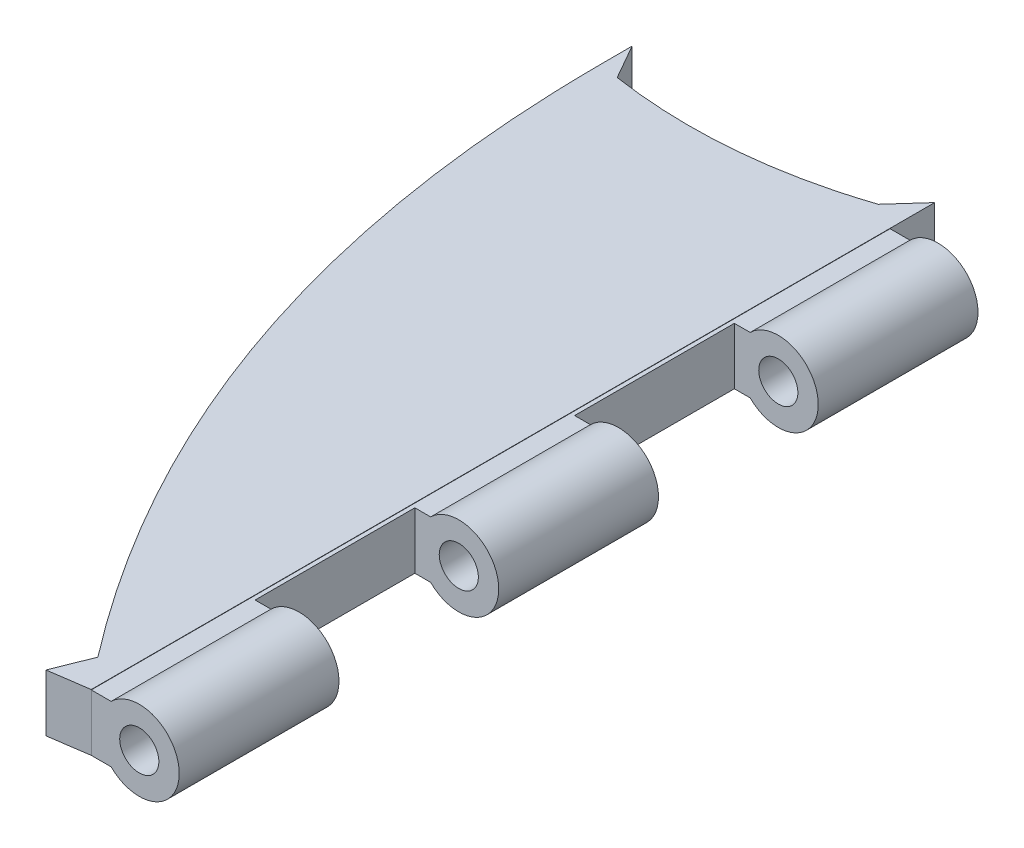
ISO-10303-21;
HEADER;
FILE_DESCRIPTION(('STEP AP214'),'2;1');
FILE_NAME('part.step','',(''),(''),'','','');
FILE_SCHEMA(('AUTOMOTIVE_DESIGN { 1 0 10303 214 1 1 1 1 }'));
ENDSEC;
DATA;
#1=APPLICATION_CONTEXT('core data for automotive mechanical design processes');
#2=APPLICATION_PROTOCOL_DEFINITION('international standard','automotive_design',2000,#1);
#3=PRODUCT_CONTEXT('',#1,'mechanical');
#4=PRODUCT('Part','Part','',(#3));
#5=PRODUCT_RELATED_PRODUCT_CATEGORY('part','',(#4));
#6=PRODUCT_DEFINITION_FORMATION('','',#4);
#7=PRODUCT_DEFINITION_CONTEXT('part definition',#1,'design');
#8=PRODUCT_DEFINITION('design','',#6,#7);
#9=PRODUCT_DEFINITION_SHAPE('','',#8);
#10=(LENGTH_UNIT() NAMED_UNIT(*) SI_UNIT(.MILLI.,.METRE.));
#11=(NAMED_UNIT(*) PLANE_ANGLE_UNIT() SI_UNIT($,.RADIAN.));
#12=(NAMED_UNIT(*) SI_UNIT($,.STERADIAN.) SOLID_ANGLE_UNIT());
#13=UNCERTAINTY_MEASURE_WITH_UNIT(LENGTH_MEASURE(1.E-05),#10,'distance_accuracy_value','');
#14=(GEOMETRIC_REPRESENTATION_CONTEXT(3) GLOBAL_UNCERTAINTY_ASSIGNED_CONTEXT((#13)) GLOBAL_UNIT_ASSIGNED_CONTEXT((#10,
#11,#12)) REPRESENTATION_CONTEXT('',''));
#15=CARTESIAN_POINT('',(0.,0.,0.));
#16=DIRECTION('',(0.,0.,1.));
#17=DIRECTION('',(1.,0.,0.));
#18=AXIS2_PLACEMENT_3D('',#15,#16,#17);
#19=CARTESIAN_POINT('',(32.973414944307,-27.0329938832796,64.215461931735));
#20=DIRECTION('',(1.,0.,0.));
#21=DIRECTION('',(0.,0.,-1.));
#22=AXIS2_PLACEMENT_3D('',#19,#20,#21);
#23=PLANE('',#22);
#24=DIRECTION('',(0.,0.,-1.));
#25=VECTOR('',#24,1.);
#26=CARTESIAN_POINT('',(32.973414944307,-22.2115612420524,85.1997859033219));
#27=LINE('',#26,#25);
#28=CARTESIAN_POINT('',(32.973414944307,-22.2115612420524,105.673013537152));
#29=VERTEX_POINT('',#28);
#30=CARTESIAN_POINT('',(32.973414944307,-22.2115612420524,68.719194514338));
#31=VERTEX_POINT('',#30);
#32=EDGE_CURVE('P0_E180',#29,#31,#27,.T.);
#33=ORIENTED_EDGE('',*,*,#32,.F.);
#34=DIRECTION('',(0.,-1.,0.));
#35=VECTOR('',#34,1.);
#36=CARTESIAN_POINT('',(32.973414944307,-22.2115612420524,105.673013537152));
#37=LINE('',#36,#35);
#38=CARTESIAN_POINT('',(32.973414944307,-24.7115612420524,105.673013537152));
#39=VERTEX_POINT('',#38);
#40=EDGE_CURVE('P0_E21',#29,#39,#37,.T.);
#41=ORIENTED_EDGE('',*,*,#40,.T.);
#42=DIRECTION('',(0.,0.,-1.));
#43=VECTOR('',#42,1.);
#44=CARTESIAN_POINT('',(32.973414944307,-24.7115612420524,85.1997859033219));
#45=LINE('',#44,#43);
#46=CARTESIAN_POINT('',(32.973414944307,-24.7115612420524,68.719194514338));
#47=VERTEX_POINT('',#46);
#48=EDGE_CURVE('P0_E181',#39,#47,#45,.T.);
#49=ORIENTED_EDGE('',*,*,#48,.T.);
#50=DIRECTION('',(0.,-1.,0.));
#51=VECTOR('',#50,1.);
#52=CARTESIAN_POINT('',(32.973414944307,-22.2115612420524,68.719194514338));
#53=LINE('',#52,#51);
#54=EDGE_CURVE('P0_E36',#31,#47,#53,.T.);
#55=ORIENTED_EDGE('',*,*,#54,.F.);
#56=EDGE_LOOP('',(#33,#41,#49,#55));
#57=FACE_BOUND('',#56,.T.);
#58=ADVANCED_FACE('P0_F17',(#57),#23,.T.);
#59=CARTESIAN_POINT('',(28.5920164881596,-22.2115612420524,73.5836619992147));
#60=DIRECTION('',(-0.743037546914948,0.,-0.669249732069141));
#61=DIRECTION('',(-0.669249732069141,0.,0.743037546914948));
#62=AXIS2_PLACEMENT_3D('',#59,#60,#61);
#63=PLANE('',#62);
#64=DIRECTION('',(0.669249732069141,0.,-0.743037546914948));
#65=VECTOR('',#64,1.);
#66=CARTESIAN_POINT('',(28.5920164881596,-24.7115612420524,73.5836619992147));
#67=LINE('',#66,#65);
#68=CARTESIAN_POINT('',(31.802227913186,-24.7115612420524,70.0195102214392));
#69=VERTEX_POINT('',#68);
#70=EDGE_CURVE('P0_E11',#69,#47,#67,.T.);
#71=ORIENTED_EDGE('',*,*,#70,.F.);
#72=DIRECTION('',(0.,-1.,0.));
#73=VECTOR('',#72,1.);
#74=CARTESIAN_POINT('',(31.802227913186,-22.2115612420524,70.0195102214392));
#75=LINE('',#74,#73);
#76=CARTESIAN_POINT('',(31.802227913186,-22.2115612420524,70.0195102214392));
#77=VERTEX_POINT('',#76);
#78=EDGE_CURVE('P0_E62',#77,#69,#75,.T.);
#79=ORIENTED_EDGE('',*,*,#78,.F.);
#80=DIRECTION('',(0.669249732069141,0.,-0.743037546914948));
#81=VECTOR('',#80,1.);
#82=CARTESIAN_POINT('',(28.5920164881596,-22.2115612420524,73.5836619992147));
#83=LINE('',#82,#81);
#84=EDGE_CURVE('P0_E173',#77,#31,#83,.T.);
#85=ORIENTED_EDGE('',*,*,#84,.T.);
#86=ORIENTED_EDGE('',*,*,#54,.T.);
#87=EDGE_LOOP('',(#71,#79,#85,#86));
#88=FACE_BOUND('',#87,.T.);
#89=ADVANCED_FACE('P0_F152',(#88),#63,.T.);
#90=CARTESIAN_POINT('',(21.2730054031297,-22.2115612420524,70.929062851696));
#91=CARTESIAN_POINT('',(23.1096896542794,-22.2115612420524,71.2034177692164));
#92=CARTESIAN_POINT('',(26.6576690567559,-22.2115612420524,71.309837281146));
#93=CARTESIAN_POINT('',(30.1273092090926,-22.2115612420524,70.5771027146462));
#94=CARTESIAN_POINT('',(31.802227913186,-22.2115612420524,70.0195102214392));
#95=B_SPLINE_CURVE_WITH_KNOTS('',3,(#90,#91,#92,#93,#94),.UNSPECIFIED.,.F.,.F.,(4,1,4),
(0.0670189865663111,0.495699029989057,0.904472852935776),.UNSPECIFIED.);
#96=DIRECTION('',(0.,-1.,0.));
#97=VECTOR('',#96,1.);
#98=SURFACE_OF_LINEAR_EXTRUSION('',#95,#97);
#99=CARTESIAN_POINT('',(21.2730054031297,-24.7115612420524,70.929062851696));
#100=CARTESIAN_POINT('',(23.1096896542794,-24.7115612420524,71.2034177692164));
#101=CARTESIAN_POINT('',(26.6576690567559,-24.7115612420524,71.309837281146));
#102=CARTESIAN_POINT('',(30.1273092090926,-24.7115612420524,70.5771027146462));
#103=CARTESIAN_POINT('',(31.802227913186,-24.7115612420524,70.0195102214392));
#104=B_SPLINE_CURVE_WITH_KNOTS('',3,(#99,#100,#101,#102,#103),.UNSPECIFIED.,.F.,.F.,(4,1,4),
(0.0670189865663111,0.495699029989057,0.904472852935776),.UNSPECIFIED.);
#105=CARTESIAN_POINT('',(21.2730054031295,-24.7115612420524,70.929062851696));
#106=VERTEX_POINT('',#105);
#107=EDGE_CURVE('P0_E27',#106,#69,#104,.T.);
#108=ORIENTED_EDGE('',*,*,#107,.F.);
#109=DIRECTION('',(0.,-1.,0.));
#110=VECTOR('',#109,1.);
#111=CARTESIAN_POINT('',(21.2730054031295,-22.2115612420524,70.929062851696));
#112=LINE('',#111,#110);
#113=CARTESIAN_POINT('',(21.2730054031295,-22.2115612420524,70.929062851696));
#114=VERTEX_POINT('',#113);
#115=EDGE_CURVE('P0_E87',#114,#106,#112,.T.);
#116=ORIENTED_EDGE('',*,*,#115,.F.);
#117=EDGE_CURVE('P0_E168',#114,#77,#95,.T.);
#118=ORIENTED_EDGE('',*,*,#117,.T.);
#119=ORIENTED_EDGE('',*,*,#78,.T.);
#120=EDGE_LOOP('',(#108,#116,#118,#119));
#121=FACE_BOUND('',#120,.T.);
#122=ADVANCED_FACE('P0_F101',(#121),#98,.T.);
#123=CARTESIAN_POINT('',(32.3640598845518,-22.2115612420524,90.3980028418056));
#124=DIRECTION('',(0.868897082531414,0.,-0.494992787794325));
#125=DIRECTION('',(-0.494992787794325,0.,-0.868897082531414));
#126=AXIS2_PLACEMENT_3D('',#123,#124,#125);
#127=PLANE('',#126);
#128=DIRECTION('',(0.494992787794325,0.,0.868897082531414));
#129=VECTOR('',#128,1.);
#130=CARTESIAN_POINT('',(32.3640598845518,-24.7115612420524,90.3980028418056));
#131=LINE('',#130,#129);
#132=CARTESIAN_POINT('',(20.4067680244895,-24.7115612420524,69.4084929572661));
#133=VERTEX_POINT('',#132);
#134=EDGE_CURVE('P0_E91',#133,#106,#131,.T.);
#135=ORIENTED_EDGE('',*,*,#134,.F.);
#136=DIRECTION('',(0.,-1.,0.));
#137=VECTOR('',#136,1.);
#138=CARTESIAN_POINT('',(20.4067680244895,-22.2115612420524,69.4084929572661));
#139=LINE('',#138,#137);
#140=CARTESIAN_POINT('',(20.4067680244895,-22.2115612420524,69.4084929572661));
#141=VERTEX_POINT('',#140);
#142=EDGE_CURVE('P0_E98',#141,#133,#139,.T.);
#143=ORIENTED_EDGE('',*,*,#142,.F.);
#144=DIRECTION('',(0.494992787794325,0.,0.868897082531414));
#145=VECTOR('',#144,1.);
#146=CARTESIAN_POINT('',(32.3640598845518,-22.2115612420524,90.3980028418056));
#147=LINE('',#146,#145);
#148=EDGE_CURVE('P0_E94',#141,#114,#147,.T.);
#149=ORIENTED_EDGE('',*,*,#148,.T.);
#150=ORIENTED_EDGE('',*,*,#115,.T.);
#151=EDGE_LOOP('',(#135,#143,#149,#150));
#152=FACE_BOUND('',#151,.T.);
#153=ADVANCED_FACE('P0_F89',(#152),#127,.T.);
#154=CARTESIAN_POINT('',(20.4447847920618,-22.2115612420524,85.2502870093976));
#155=DIRECTION('',(-0.999997120548435,0.,0.00239976974702144));
#156=DIRECTION('',(0.00239976974702144,0.,0.999997120548435));
#157=AXIS2_PLACEMENT_3D('',#154,#155,#156);
#158=PLANE('',#157);
#159=DIRECTION('',(-0.00239976974702139,0.,-0.999997120548435));
#160=VECTOR('',#159,1.);
#161=CARTESIAN_POINT('',(20.4447847920618,-24.7115612420524,85.2502870093976));
#162=LINE('',#161,#160);
#163=CARTESIAN_POINT('',(20.410069567425,-24.7115612420524,70.7842638756756));
#164=VERTEX_POINT('',#163);
#165=EDGE_CURVE('P0_E106',#164,#133,#162,.T.);
#166=ORIENTED_EDGE('',*,*,#165,.F.);
#167=DIRECTION('',(0.,-1.,0.));
#168=VECTOR('',#167,1.);
#169=CARTESIAN_POINT('',(20.410069567425,-22.2115612420524,70.7842638756756));
#170=LINE('',#169,#168);
#171=CARTESIAN_POINT('',(20.410069567425,-22.2115612420524,70.7842638756756));
#172=VERTEX_POINT('',#171);
#173=EDGE_CURVE('P0_E199',#172,#164,#170,.T.);
#174=ORIENTED_EDGE('',*,*,#173,.F.);
#175=DIRECTION('',(-0.00239976974702139,0.,-0.999997120548435));
#176=VECTOR('',#175,1.);
#177=CARTESIAN_POINT('',(20.4447847920618,-22.2115612420524,85.2502870093976));
#178=LINE('',#177,#176);
#179=EDGE_CURVE('P0_E130',#172,#141,#178,.T.);
#180=ORIENTED_EDGE('',*,*,#179,.T.);
#181=ORIENTED_EDGE('',*,*,#142,.T.);
#182=EDGE_LOOP('',(#166,#174,#180,#181));
#183=FACE_BOUND('',#182,.T.);
#184=ADVANCED_FACE('P0_F141',(#183),#158,.T.);
#185=CARTESIAN_POINT('',(31.88919561052,-22.2115612420524,104.299118356844));
#186=CARTESIAN_POINT('',(27.5352563796172,-22.2115612420524,98.6219746511642));
#187=CARTESIAN_POINT('',(22.0807405597158,-22.2115612420524,87.9786598345144));
#188=CARTESIAN_POINT('',(20.4228343326632,-22.2115612420524,76.1034110557655));
#189=CARTESIAN_POINT('',(20.410069567425,-22.2115612420524,70.7842638756756));
#190=B_SPLINE_CURVE_WITH_KNOTS('',3,(#185,#186,#187,#188,#189),.UNSPECIFIED.,.F.,.F.,(4,1,4),
(0.0442882229951189,0.590151953776366,1.),.UNSPECIFIED.);
#191=DIRECTION('',(0.,-1.,0.));
#192=VECTOR('',#191,1.);
#193=SURFACE_OF_LINEAR_EXTRUSION('',#190,#192);
#194=CARTESIAN_POINT('',(31.88919561052,-24.7115612420524,104.299118356844));
#195=CARTESIAN_POINT('',(27.5352563796172,-24.7115612420524,98.6219746511642));
#196=CARTESIAN_POINT('',(22.0807405597158,-24.7115612420524,87.9786598345144));
#197=CARTESIAN_POINT('',(20.4228343326632,-24.7115612420524,76.1034110557655));
#198=CARTESIAN_POINT('',(20.410069567425,-24.7115612420524,70.7842638756756));
#199=B_SPLINE_CURVE_WITH_KNOTS('',3,(#194,#195,#196,#197,#198),.UNSPECIFIED.,.F.,.F.,(4,1,4),
(0.0442882229951189,0.590151953776366,1.),.UNSPECIFIED.);
#200=CARTESIAN_POINT('',(31.88919561052,-24.7115612420524,104.299118356844));
#201=VERTEX_POINT('',#200);
#202=EDGE_CURVE('P0_E108',#201,#164,#199,.T.);
#203=ORIENTED_EDGE('',*,*,#202,.F.);
#204=DIRECTION('',(0.,-1.,0.));
#205=VECTOR('',#204,1.);
#206=CARTESIAN_POINT('',(31.88919561052,-22.2115612420524,104.299118356844));
#207=LINE('',#206,#205);
#208=CARTESIAN_POINT('',(31.88919561052,-22.2115612420524,104.299118356844));
#209=VERTEX_POINT('',#208);
#210=EDGE_CURVE('P0_E197',#209,#201,#207,.T.);
#211=ORIENTED_EDGE('',*,*,#210,.F.);
#212=EDGE_CURVE('P0_E124',#209,#172,#190,.T.);
#213=ORIENTED_EDGE('',*,*,#212,.T.);
#214=ORIENTED_EDGE('',*,*,#173,.T.);
#215=EDGE_LOOP('',(#203,#211,#213,#214));
#216=FACE_BOUND('',#215,.T.);
#217=ADVANCED_FACE('P0_F136',(#216),#193,.T.);
#218=CARTESIAN_POINT('',(39.7693595415543,-22.2115612420524,84.5148952432156));
#219=DIRECTION('',(-0.929018549554536,0.,-0.370033153357351));
#220=DIRECTION('',(-0.370033153357351,0.,0.929018549554537));
#221=AXIS2_PLACEMENT_3D('',#218,#219,#220);
#222=PLANE('',#221);
#223=DIRECTION('',(0.370033153357351,0.,-0.929018549554537));
#224=VECTOR('',#223,1.);
#225=CARTESIAN_POINT('',(39.7693595415543,-24.7115612420524,84.5148952432156));
#226=LINE('',#225,#224);
#227=CARTESIAN_POINT('',(31.2416375921447,-24.7115612420524,105.924900818565));
#228=VERTEX_POINT('',#227);
#229=EDGE_CURVE('P0_E186',#228,#201,#226,.T.);
#230=ORIENTED_EDGE('',*,*,#229,.F.);
#231=DIRECTION('',(0.,-1.,0.));
#232=VECTOR('',#231,1.);
#233=CARTESIAN_POINT('',(31.2416375921447,-22.2115612420524,105.924900818565));
#234=LINE('',#233,#232);
#235=CARTESIAN_POINT('',(31.2416375921447,-22.2115612420524,105.924900818565));
#236=VERTEX_POINT('',#235);
#237=EDGE_CURVE('P0_E121',#236,#228,#234,.T.);
#238=ORIENTED_EDGE('',*,*,#237,.F.);
#239=DIRECTION('',(0.370033153357351,0.,-0.929018549554537));
#240=VECTOR('',#239,1.);
#241=CARTESIAN_POINT('',(39.7693595415543,-22.2115612420524,84.5148952432156));
#242=LINE('',#241,#240);
#243=EDGE_CURVE('P0_E120',#236,#209,#242,.T.);
#244=ORIENTED_EDGE('',*,*,#243,.T.);
#245=ORIENTED_EDGE('',*,*,#210,.T.);
#246=EDGE_LOOP('',(#230,#238,#244,#245));
#247=FACE_BOUND('',#246,.T.);
#248=ADVANCED_FACE('P0_F140',(#247),#222,.T.);
#249=CARTESIAN_POINT('',(44.2285930733944,-22.2115612420524,104.035946152473));
#250=DIRECTION('',(0.143935589378699,0.,0.989587058378497));
#251=DIRECTION('',(0.989587058378497,0.,-0.143935589378699));
#252=AXIS2_PLACEMENT_3D('',#249,#250,#251);
#253=PLANE('',#252);
#254=DIRECTION('',(-0.989587058378497,0.,0.143935589378699));
#255=VECTOR('',#254,1.);
#256=CARTESIAN_POINT('',(44.2285930733944,-24.7115612420524,104.035946152473));
#257=LINE('',#256,#255);
#258=EDGE_CURVE('P0_E178',#39,#228,#257,.T.);
#259=ORIENTED_EDGE('',*,*,#258,.F.);
#260=ORIENTED_EDGE('',*,*,#40,.F.);
#261=DIRECTION('',(-0.989587058378497,0.,0.143935589378699));
#262=VECTOR('',#261,1.);
#263=CARTESIAN_POINT('',(44.2285930733944,-22.2115612420524,104.035946152473));
#264=LINE('',#263,#262);
#265=EDGE_CURVE('P0_E117',#29,#236,#264,.T.);
#266=ORIENTED_EDGE('',*,*,#265,.T.);
#267=ORIENTED_EDGE('',*,*,#237,.T.);
#268=EDGE_LOOP('',(#259,#260,#266,#267));
#269=FACE_BOUND('',#268,.T.);
#270=ADVANCED_FACE('P0_F146',(#269),#253,.T.);
#271=CARTESIAN_POINT('',(41.4888706769277,-24.7115612420524,85.1997859033219));
#272=DIRECTION('',(0.,1.,0.));
#273=DIRECTION('',(0.776114000116265,0.,-0.630592625094466));
#274=AXIS2_PLACEMENT_3D('',#271,#272,#273);
#275=PLANE('',#274);
#276=ORIENTED_EDGE('',*,*,#48,.F.);
#277=ORIENTED_EDGE('',*,*,#258,.T.);
#278=ORIENTED_EDGE('',*,*,#229,.T.);
#279=ORIENTED_EDGE('',*,*,#202,.T.);
#280=ORIENTED_EDGE('',*,*,#165,.T.);
#281=ORIENTED_EDGE('',*,*,#134,.T.);
#282=ORIENTED_EDGE('',*,*,#107,.T.);
#283=ORIENTED_EDGE('',*,*,#70,.T.);
#284=EDGE_LOOP('',(#276,#277,#278,#279,#280,#281,#282,#283));
#285=FACE_BOUND('',#284,.T.);
#286=ADVANCED_FACE('P0_F19',(#285),#275,.F.);
#287=CARTESIAN_POINT('',(41.4888706769277,-22.2115612420524,85.1997859033219));
#288=DIRECTION('',(0.,1.,0.));
#289=DIRECTION('',(0.776114000116265,0.,-0.630592625094466));
#290=AXIS2_PLACEMENT_3D('',#287,#288,#289);
#291=PLANE('',#290);
#292=ORIENTED_EDGE('',*,*,#265,.F.);
#293=ORIENTED_EDGE('',*,*,#32,.T.);
#294=ORIENTED_EDGE('',*,*,#84,.F.);
#295=ORIENTED_EDGE('',*,*,#117,.F.);
#296=ORIENTED_EDGE('',*,*,#148,.F.);
#297=ORIENTED_EDGE('',*,*,#179,.F.);
#298=ORIENTED_EDGE('',*,*,#212,.F.);
#299=ORIENTED_EDGE('',*,*,#243,.F.);
#300=EDGE_LOOP('',(#292,#293,#294,#295,#296,#297,#298,#299));
#301=FACE_BOUND('',#300,.T.);
#302=ADVANCED_FACE('P0_F153',(#301),#291,.T.);
#303=CLOSED_SHELL('',(#58,#89,#122,#153,#184,#217,#248,#270,#286,#302));
#304=MANIFOLD_SOLID_BREP('P0_B1',#303);
#305=CARTESIAN_POINT('',(35.076679129256,-23.4690612420524,105.673013537152));
#306=DIRECTION('',(0.,0.,1.));
#307=DIRECTION('',(1.,0.,0.));
#308=AXIS2_PLACEMENT_3D('',#305,#306,#307);
#309=CYLINDRICAL_SURFACE('',#308,1.75);
#310=DIRECTION('',(0.,0.,1.));
#311=VECTOR('',#310,1.);
#312=CARTESIAN_POINT('',(33.8443261968539,-24.7115612420524,105.673013537152));
#313=LINE('',#312,#311);
#314=CARTESIAN_POINT('',(33.8443261968539,-24.7115612420524,91.6730135371521));
#315=VERTEX_POINT('',#314);
#316=CARTESIAN_POINT('',(33.8443261968539,-24.7115612420524,84.6730135371521));
#317=VERTEX_POINT('',#316);
#318=EDGE_CURVE('P1_E86',#315,#317,#313,.F.);
#319=ORIENTED_EDGE('',*,*,#318,.T.);
#320=CARTESIAN_POINT('',(35.076679129256,-23.4690612420524,84.6730135371521));
#321=DIRECTION('',(0.,0.,1.));
#322=DIRECTION('',(1.,0.,0.));
#323=AXIS2_PLACEMENT_3D('',#320,#321,#322);
#324=CIRCLE('',#323,1.75);
#325=CARTESIAN_POINT('',(33.8443261968539,-22.2265612420524,84.6730135371521));
#326=VERTEX_POINT('',#325);
#327=EDGE_CURVE('P1_E95',#326,#317,#324,.F.);
#328=ORIENTED_EDGE('',*,*,#327,.F.);
#329=DIRECTION('',(0.,0.,1.));
#330=VECTOR('',#329,1.);
#331=CARTESIAN_POINT('',(33.8443261968539,-22.2265612420524,105.673013537152));
#332=LINE('',#331,#330);
#333=CARTESIAN_POINT('',(33.8443261968539,-22.2265612420524,91.6730135371521));
#334=VERTEX_POINT('',#333);
#335=EDGE_CURVE('P1_E176',#334,#326,#332,.F.);
#336=ORIENTED_EDGE('',*,*,#335,.F.);
#337=CARTESIAN_POINT('',(35.076679129256,-23.4690612420524,91.6730135371521));
#338=DIRECTION('',(0.,0.,-1.));
#339=DIRECTION('',(-1.,0.,0.));
#340=AXIS2_PLACEMENT_3D('',#337,#338,#339);
#341=CIRCLE('',#340,1.75);
#342=EDGE_CURVE('P1_E85',#315,#334,#341,.F.);
#343=ORIENTED_EDGE('',*,*,#342,.F.);
#344=EDGE_LOOP('',(#319,#328,#336,#343));
#345=FACE_BOUND('',#344,.T.);
#346=ADVANCED_FACE('P1_F16',(#345),#309,.T.);
#347=CARTESIAN_POINT('',(35.076679129256,-23.4690612420524,77.6730135371521));
#348=DIRECTION('',(0.,0.,-1.));
#349=DIRECTION('',(-1.,0.,0.));
#350=AXIS2_PLACEMENT_3D('',#347,#348,#349);
#351=CIRCLE('',#350,1.75);
#352=CARTESIAN_POINT('',(33.8443261968539,-24.7115612420524,77.6730135371521));
#353=VERTEX_POINT('',#352);
#354=CARTESIAN_POINT('',(33.8443261968539,-22.2265612420524,77.6730135371521));
#355=VERTEX_POINT('',#354);
#356=EDGE_CURVE('P1_E92',#353,#355,#351,.F.);
#357=ORIENTED_EDGE('',*,*,#356,.F.);
#358=CARTESIAN_POINT('',(33.8443261968539,-24.7115612420524,70.6730135371521));
#359=VERTEX_POINT('',#358);
#360=EDGE_CURVE('P1_E31',#353,#359,#313,.F.);
#361=ORIENTED_EDGE('',*,*,#360,.T.);
#362=CARTESIAN_POINT('',(35.076679129256,-23.4690612420524,70.6730135371521));
#363=DIRECTION('',(0.,0.,1.));
#364=DIRECTION('',(1.,0.,0.));
#365=AXIS2_PLACEMENT_3D('',#362,#363,#364);
#366=CIRCLE('',#365,1.75);
#367=CARTESIAN_POINT('',(33.8443261968539,-22.2265612420524,70.6730135371521));
#368=VERTEX_POINT('',#367);
#369=EDGE_CURVE('P1_E169',#359,#368,#366,.T.);
#370=ORIENTED_EDGE('',*,*,#369,.T.);
#371=EDGE_CURVE('P1_E173',#355,#368,#332,.F.);
#372=ORIENTED_EDGE('',*,*,#371,.F.);
#373=EDGE_LOOP('',(#357,#361,#370,#372));
#374=FACE_BOUND('',#373,.T.);
#375=ADVANCED_FACE('P1_F262',(#374),#309,.T.);
#376=CARTESIAN_POINT('',(33.8443261968539,-24.7115612420524,105.673013537152));
#377=VERTEX_POINT('',#376);
#378=CARTESIAN_POINT('',(33.8443261968539,-24.7115612420524,98.6730135371521));
#379=VERTEX_POINT('',#378);
#380=EDGE_CURVE('P1_E77',#377,#379,#313,.F.);
#381=ORIENTED_EDGE('',*,*,#380,.T.);
#382=CARTESIAN_POINT('',(35.076679129256,-23.4690612420524,98.6730135371521));
#383=DIRECTION('',(0.,0.,1.));
#384=DIRECTION('',(1.,0.,0.));
#385=AXIS2_PLACEMENT_3D('',#382,#383,#384);
#386=CIRCLE('',#385,1.75);
#387=CARTESIAN_POINT('',(33.8443261968539,-22.2265612420524,98.6730135371521));
#388=VERTEX_POINT('',#387);
#389=EDGE_CURVE('P1_E89',#388,#379,#386,.F.);
#390=ORIENTED_EDGE('',*,*,#389,.F.);
#391=CARTESIAN_POINT('',(33.8443261968539,-22.2265612420524,105.673013537152));
#392=VERTEX_POINT('',#391);
#393=EDGE_CURVE('P1_E174',#392,#388,#332,.F.);
#394=ORIENTED_EDGE('',*,*,#393,.F.);
#395=CARTESIAN_POINT('',(35.076679129256,-23.4690612420524,105.673013537152));
#396=DIRECTION('',(0.,0.,1.));
#397=DIRECTION('',(1.,0.,0.));
#398=AXIS2_PLACEMENT_3D('',#395,#396,#397);
#399=CIRCLE('',#398,1.75);
#400=EDGE_CURVE('P1_E171',#377,#392,#399,.T.);
#401=ORIENTED_EDGE('',*,*,#400,.F.);
#402=EDGE_LOOP('',(#381,#390,#394,#401));
#403=FACE_BOUND('',#402,.T.);
#404=ADVANCED_FACE('P1_F216',(#403),#309,.T.);
#405=CARTESIAN_POINT('',(35.076679129256,-22.2265612420524,70.6730135371521));
#406=DIRECTION('',(0.,0.,1.));
#407=DIRECTION('',(1.,0.,0.));
#408=AXIS2_PLACEMENT_3D('',#405,#406,#407);
#409=PLANE('',#408);
#410=CARTESIAN_POINT('',(35.076679129256,-23.4690612420524,70.6730135371521));
#411=DIRECTION('',(0.,0.,1.));
#412=DIRECTION('',(1.,0.,0.));
#413=AXIS2_PLACEMENT_3D('',#410,#411,#412);
#414=CIRCLE('',#413,0.8575);
#415=CARTESIAN_POINT('',(35.934179129256,-23.4690612420524,70.6730135371521));
#416=VERTEX_POINT('',#415);
#417=EDGE_CURVE('P1_E146',#416,#416,#414,.T.);
#418=ORIENTED_EDGE('',*,*,#417,.T.);
#419=EDGE_LOOP('',(#418));
#420=FACE_BOUND('',#419,.T.);
#421=DIRECTION('',(-1.,0.,0.));
#422=VECTOR('',#421,1.);
#423=CARTESIAN_POINT('',(35.076679129256,-22.2265612420524,70.6730135371521));
#424=LINE('',#423,#422);
#425=CARTESIAN_POINT('',(32.973414944307,-22.2265612420524,70.6730135371521));
#426=VERTEX_POINT('',#425);
#427=EDGE_CURVE('P1_E78',#368,#426,#424,.T.);
#428=ORIENTED_EDGE('',*,*,#427,.F.);
#429=ORIENTED_EDGE('',*,*,#369,.F.);
#430=DIRECTION('',(-1.,0.,0.));
#431=VECTOR('',#430,1.);
#432=CARTESIAN_POINT('',(35.076679129256,-24.7115612420524,70.6730135371521));
#433=LINE('',#432,#431);
#434=CARTESIAN_POINT('',(32.973414944307,-24.7115612420524,70.6730135371521));
#435=VERTEX_POINT('',#434);
#436=EDGE_CURVE('P1_E64',#359,#435,#433,.T.);
#437=ORIENTED_EDGE('',*,*,#436,.T.);
#438=DIRECTION('',(0.,-1.,0.));
#439=VECTOR('',#438,1.);
#440=CARTESIAN_POINT('',(32.973414944307,-22.2265612420524,70.6730135371521));
#441=LINE('',#440,#439);
#442=EDGE_CURVE('P1_E59',#426,#435,#441,.T.);
#443=ORIENTED_EDGE('',*,*,#442,.F.);
#444=EDGE_LOOP('',(#428,#429,#437,#443));
#445=FACE_BOUND('',#444,.T.);
#446=ADVANCED_FACE('P1_F18',(#420,#445),#409,.F.);
#447=CARTESIAN_POINT('',(32.973414944307,-22.2265612420524,70.6730135371521));
#448=DIRECTION('',(1.,0.,0.));
#449=DIRECTION('',(0.,0.,-1.));
#450=AXIS2_PLACEMENT_3D('',#447,#448,#449);
#451=PLANE('',#450);
#452=DIRECTION('',(0.,0.,1.));
#453=VECTOR('',#452,1.);
#454=CARTESIAN_POINT('',(32.973414944307,-24.7115612420524,70.6730135371521));
#455=LINE('',#454,#453);
#456=CARTESIAN_POINT('',(32.973414944307,-24.7115612420524,105.673013537152));
#457=VERTEX_POINT('',#456);
#458=EDGE_CURVE('P1_E53',#435,#457,#455,.T.);
#459=ORIENTED_EDGE('',*,*,#458,.T.);
#460=DIRECTION('',(0.,-1.,0.));
#461=VECTOR('',#460,1.);
#462=CARTESIAN_POINT('',(32.973414944307,-22.2265612420524,105.673013537152));
#463=LINE('',#462,#461);
#464=CARTESIAN_POINT('',(32.973414944307,-22.2265612420524,105.673013537152));
#465=VERTEX_POINT('',#464);
#466=EDGE_CURVE('P1_E56',#465,#457,#463,.T.);
#467=ORIENTED_EDGE('',*,*,#466,.F.);
#468=DIRECTION('',(0.,0.,1.));
#469=VECTOR('',#468,1.);
#470=CARTESIAN_POINT('',(32.973414944307,-22.2265612420524,70.6730135371521));
#471=LINE('',#470,#469);
#472=EDGE_CURVE('P1_E40',#426,#465,#471,.T.);
#473=ORIENTED_EDGE('',*,*,#472,.F.);
#474=ORIENTED_EDGE('',*,*,#442,.T.);
#475=EDGE_LOOP('',(#459,#467,#473,#474));
#476=FACE_BOUND('',#475,.T.);
#477=ADVANCED_FACE('P1_F55',(#476),#451,.F.);
#478=CARTESIAN_POINT('',(35.076679129256,-22.2265612420524,105.673013537152));
#479=DIRECTION('',(0.,0.,-1.));
#480=DIRECTION('',(-1.,0.,0.));
#481=AXIS2_PLACEMENT_3D('',#478,#479,#480);
#482=PLANE('',#481);
#483=CARTESIAN_POINT('',(35.076679129256,-23.4690612420524,105.673013537152));
#484=DIRECTION('',(0.,0.,-1.));
#485=DIRECTION('',(-1.,0.,0.));
#486=AXIS2_PLACEMENT_3D('',#483,#484,#485);
#487=CIRCLE('',#486,0.8575);
#488=CARTESIAN_POINT('',(34.219179129256,-23.4690612420524,105.673013537152));
#489=VERTEX_POINT('',#488);
#490=EDGE_CURVE('P1_E101',#489,#489,#487,.T.);
#491=ORIENTED_EDGE('',*,*,#490,.T.);
#492=EDGE_LOOP('',(#491));
#493=FACE_BOUND('',#492,.T.);
#494=DIRECTION('',(1.,0.,0.));
#495=VECTOR('',#494,1.);
#496=CARTESIAN_POINT('',(35.076679129256,-24.7115612420524,105.673013537152));
#497=LINE('',#496,#495);
#498=EDGE_CURVE('P1_E63',#457,#377,#497,.T.);
#499=ORIENTED_EDGE('',*,*,#498,.T.);
#500=ORIENTED_EDGE('',*,*,#400,.T.);
#501=DIRECTION('',(1.,0.,0.));
#502=VECTOR('',#501,1.);
#503=CARTESIAN_POINT('',(35.076679129256,-22.2265612420524,105.673013537152));
#504=LINE('',#503,#502);
#505=EDGE_CURVE('P1_E70',#465,#392,#504,.T.);
#506=ORIENTED_EDGE('',*,*,#505,.F.);
#507=ORIENTED_EDGE('',*,*,#466,.T.);
#508=EDGE_LOOP('',(#499,#500,#506,#507));
#509=FACE_BOUND('',#508,.T.);
#510=ADVANCED_FACE('P1_F68',(#493,#509),#482,.F.);
#511=CARTESIAN_POINT('',(29.2980715049632,-22.2265612420524,70.6730135371521));
#512=DIRECTION('',(0.,-1.,0.));
#513=DIRECTION('',(0.,0.,-1.));
#514=AXIS2_PLACEMENT_3D('',#511,#512,#513);
#515=PLANE('',#514);
#516=DIRECTION('',(-1.,0.,0.));
#517=VECTOR('',#516,1.);
#518=CARTESIAN_POINT('',(29.2980715049632,-22.2265612420524,98.6730135371521));
#519=LINE('',#518,#517);
#520=CARTESIAN_POINT('',(33.151679129256,-22.2265612420524,98.6730135371521));
#521=VERTEX_POINT('',#520);
#522=EDGE_CURVE('P1_E155',#388,#521,#519,.T.);
#523=ORIENTED_EDGE('',*,*,#522,.T.);
#524=DIRECTION('',(0.,0.,1.));
#525=VECTOR('',#524,1.);
#526=CARTESIAN_POINT('',(33.151679129256,-22.2265612420524,98.6730135371521));
#527=LINE('',#526,#525);
#528=CARTESIAN_POINT('',(33.151679129256,-22.2265612420524,91.6730135371521));
#529=VERTEX_POINT('',#528);
#530=EDGE_CURVE('P1_E131',#529,#521,#527,.T.);
#531=ORIENTED_EDGE('',*,*,#530,.F.);
#532=DIRECTION('',(1.,0.,0.));
#533=VECTOR('',#532,1.);
#534=CARTESIAN_POINT('',(29.2980715049631,-22.2265612420524,91.6730135371521));
#535=LINE('',#534,#533);
#536=EDGE_CURVE('P1_E152',#529,#334,#535,.T.);
#537=ORIENTED_EDGE('',*,*,#536,.T.);
#538=ORIENTED_EDGE('',*,*,#335,.T.);
#539=DIRECTION('',(-1.,0.,0.));
#540=VECTOR('',#539,1.);
#541=CARTESIAN_POINT('',(29.2980715049632,-22.2265612420524,84.6730135371521));
#542=LINE('',#541,#540);
#543=CARTESIAN_POINT('',(33.151679129256,-22.2265612420524,84.6730135371521));
#544=VERTEX_POINT('',#543);
#545=EDGE_CURVE('P1_E163',#326,#544,#542,.T.);
#546=ORIENTED_EDGE('',*,*,#545,.T.);
#547=DIRECTION('',(0.,0.,1.));
#548=VECTOR('',#547,1.);
#549=CARTESIAN_POINT('',(33.151679129256,-22.2265612420524,84.6730135371521));
#550=LINE('',#549,#548);
#551=CARTESIAN_POINT('',(33.151679129256,-22.2265612420524,77.6730135371521));
#552=VERTEX_POINT('',#551);
#553=EDGE_CURVE('P1_E129',#552,#544,#550,.T.);
#554=ORIENTED_EDGE('',*,*,#553,.F.);
#555=DIRECTION('',(1.,0.,0.));
#556=VECTOR('',#555,1.);
#557=CARTESIAN_POINT('',(29.2980715049632,-22.2265612420524,77.6730135371521));
#558=LINE('',#557,#556);
#559=EDGE_CURVE('P1_E128',#552,#355,#558,.T.);
#560=ORIENTED_EDGE('',*,*,#559,.T.);
#561=ORIENTED_EDGE('',*,*,#371,.T.);
#562=ORIENTED_EDGE('',*,*,#427,.T.);
#563=ORIENTED_EDGE('',*,*,#472,.T.);
#564=ORIENTED_EDGE('',*,*,#505,.T.);
#565=ORIENTED_EDGE('',*,*,#393,.T.);
#566=EDGE_LOOP('',(#523,#531,#537,#538,#546,#554,#560,#561,#562,#563,#564,#565));
#567=FACE_BOUND('',#566,.T.);
#568=ADVANCED_FACE('P1_F217',(#567),#515,.F.);
#569=CARTESIAN_POINT('',(29.2980715049632,-24.7115612420524,70.6730135371521));
#570=DIRECTION('',(0.,-1.,0.));
#571=DIRECTION('',(0.,0.,-1.));
#572=AXIS2_PLACEMENT_3D('',#569,#570,#571);
#573=PLANE('',#572);
#574=DIRECTION('',(0.,0.,-1.));
#575=VECTOR('',#574,1.);
#576=CARTESIAN_POINT('',(33.151679129256,-24.7115612420524,70.6730135371521));
#577=LINE('',#576,#575);
#578=CARTESIAN_POINT('',(33.151679129256,-24.7115612420524,98.6730135371521));
#579=VERTEX_POINT('',#578);
#580=CARTESIAN_POINT('',(33.151679129256,-24.7115612420524,91.6730135371521));
#581=VERTEX_POINT('',#580);
#582=EDGE_CURVE('P1_E10',#579,#581,#577,.T.);
#583=ORIENTED_EDGE('',*,*,#582,.F.);
#584=DIRECTION('',(-1.,0.,0.));
#585=VECTOR('',#584,1.);
#586=CARTESIAN_POINT('',(29.2980715049632,-24.7115612420524,98.6730135371521));
#587=LINE('',#586,#585);
#588=EDGE_CURVE('P1_E158',#379,#579,#587,.T.);
#589=ORIENTED_EDGE('',*,*,#588,.F.);
#590=ORIENTED_EDGE('',*,*,#380,.F.);
#591=ORIENTED_EDGE('',*,*,#498,.F.);
#592=ORIENTED_EDGE('',*,*,#458,.F.);
#593=ORIENTED_EDGE('',*,*,#436,.F.);
#594=ORIENTED_EDGE('',*,*,#360,.F.);
#595=DIRECTION('',(1.,0.,0.));
#596=VECTOR('',#595,1.);
#597=CARTESIAN_POINT('',(29.2980715049632,-24.7115612420524,77.6730135371521));
#598=LINE('',#597,#596);
#599=CARTESIAN_POINT('',(33.151679129256,-24.7115612420524,77.6730135371521));
#600=VERTEX_POINT('',#599);
#601=EDGE_CURVE('P1_E126',#600,#353,#598,.T.);
#602=ORIENTED_EDGE('',*,*,#601,.F.);
#603=DIRECTION('',(0.,0.,-1.));
#604=VECTOR('',#603,1.);
#605=CARTESIAN_POINT('',(33.151679129256,-24.7115612420524,70.6730135371521));
#606=LINE('',#605,#604);
#607=CARTESIAN_POINT('',(33.151679129256,-24.7115612420524,84.6730135371521));
#608=VERTEX_POINT('',#607);
#609=EDGE_CURVE('P1_E24',#608,#600,#606,.T.);
#610=ORIENTED_EDGE('',*,*,#609,.F.);
#611=DIRECTION('',(-1.,0.,0.));
#612=VECTOR('',#611,1.);
#613=CARTESIAN_POINT('',(29.2980715049632,-24.7115612420524,84.6730135371521));
#614=LINE('',#613,#612);
#615=EDGE_CURVE('P1_E166',#317,#608,#614,.T.);
#616=ORIENTED_EDGE('',*,*,#615,.F.);
#617=ORIENTED_EDGE('',*,*,#318,.F.);
#618=DIRECTION('',(1.,0.,0.));
#619=VECTOR('',#618,1.);
#620=CARTESIAN_POINT('',(29.2980715049631,-24.7115612420524,91.6730135371521));
#621=LINE('',#620,#619);
#622=EDGE_CURVE('P1_E149',#581,#315,#621,.T.);
#623=ORIENTED_EDGE('',*,*,#622,.F.);
#624=EDGE_LOOP('',(#583,#589,#590,#591,#592,#593,#594,#602,#610,#616,#617,#623));
#625=FACE_BOUND('',#624,.T.);
#626=ADVANCED_FACE('P1_F74',(#625),#573,.T.);
#627=CARTESIAN_POINT('',(33.326679129256,-25.2190612420524,98.6730135371521));
#628=DIRECTION('',(0.,0.,1.));
#629=DIRECTION('',(1.,0.,0.));
#630=AXIS2_PLACEMENT_3D('',#627,#628,#629);
#631=PLANE('',#630);
#632=CARTESIAN_POINT('',(35.076679129256,-23.4690612420524,98.6730135371521));
#633=DIRECTION('',(0.,0.,1.));
#634=DIRECTION('',(1.,0.,0.));
#635=AXIS2_PLACEMENT_3D('',#632,#633,#634);
#636=CIRCLE('',#635,0.8575);
#637=CARTESIAN_POINT('',(35.934179129256,-23.4690612420524,98.6730135371521));
#638=VERTEX_POINT('',#637);
#639=EDGE_CURVE('P1_E143',#638,#638,#636,.T.);
#640=ORIENTED_EDGE('',*,*,#639,.T.);
#641=EDGE_LOOP('',(#640));
#642=FACE_BOUND('',#641,.T.);
#643=ORIENTED_EDGE('',*,*,#588,.T.);
#644=DIRECTION('',(0.,1.,0.));
#645=VECTOR('',#644,1.);
#646=CARTESIAN_POINT('',(33.151679129256,-25.2190612420524,98.6730135371521));
#647=LINE('',#646,#645);
#648=EDGE_CURVE('P1_E137',#579,#521,#647,.T.);
#649=ORIENTED_EDGE('',*,*,#648,.T.);
#650=ORIENTED_EDGE('',*,*,#522,.F.);
#651=ORIENTED_EDGE('',*,*,#389,.T.);
#652=EDGE_LOOP('',(#643,#649,#650,#651));
#653=FACE_BOUND('',#652,.T.);
#654=ADVANCED_FACE('P1_F226',(#642,#653),#631,.F.);
#655=CARTESIAN_POINT('',(36.826679129256,-25.2190612420524,91.6730135371521));
#656=DIRECTION('',(0.,0.,-1.));
#657=DIRECTION('',(-1.,0.,0.));
#658=AXIS2_PLACEMENT_3D('',#655,#656,#657);
#659=PLANE('',#658);
#660=CARTESIAN_POINT('',(35.076679129256,-23.4690612420524,91.6730135371521));
#661=DIRECTION('',(0.,0.,-1.));
#662=DIRECTION('',(-1.,0.,0.));
#663=AXIS2_PLACEMENT_3D('',#660,#661,#662);
#664=CIRCLE('',#663,0.8575);
#665=CARTESIAN_POINT('',(34.219179129256,-23.4690612420524,91.6730135371521));
#666=VERTEX_POINT('',#665);
#667=EDGE_CURVE('P1_E140',#666,#666,#664,.T.);
#668=ORIENTED_EDGE('',*,*,#667,.T.);
#669=EDGE_LOOP('',(#668));
#670=FACE_BOUND('',#669,.T.);
#671=ORIENTED_EDGE('',*,*,#536,.F.);
#672=DIRECTION('',(0.,1.,0.));
#673=VECTOR('',#672,1.);
#674=CARTESIAN_POINT('',(33.151679129256,-25.2190612420524,91.6730135371521));
#675=LINE('',#674,#673);
#676=EDGE_CURVE('P1_E228',#581,#529,#675,.T.);
#677=ORIENTED_EDGE('',*,*,#676,.F.);
#678=ORIENTED_EDGE('',*,*,#622,.T.);
#679=ORIENTED_EDGE('',*,*,#342,.T.);
#680=EDGE_LOOP('',(#671,#677,#678,#679));
#681=FACE_BOUND('',#680,.T.);
#682=ADVANCED_FACE('P1_F239',(#670,#681),#659,.F.);
#683=CARTESIAN_POINT('',(33.326679129256,-25.2190612420524,84.6730135371521));
#684=DIRECTION('',(0.,0.,1.));
#685=DIRECTION('',(1.,0.,0.));
#686=AXIS2_PLACEMENT_3D('',#683,#684,#685);
#687=PLANE('',#686);
#688=CARTESIAN_POINT('',(35.076679129256,-23.4690612420524,84.6730135371521));
#689=DIRECTION('',(0.,0.,1.));
#690=DIRECTION('',(1.,0.,0.));
#691=AXIS2_PLACEMENT_3D('',#688,#689,#690);
#692=CIRCLE('',#691,0.8575);
#693=CARTESIAN_POINT('',(35.934179129256,-23.4690612420524,84.6730135371521));
#694=VERTEX_POINT('',#693);
#695=EDGE_CURVE('P1_E100',#694,#694,#692,.T.);
#696=ORIENTED_EDGE('',*,*,#695,.T.);
#697=EDGE_LOOP('',(#696));
#698=FACE_BOUND('',#697,.T.);
#699=ORIENTED_EDGE('',*,*,#615,.T.);
#700=DIRECTION('',(0.,1.,0.));
#701=VECTOR('',#700,1.);
#702=CARTESIAN_POINT('',(33.151679129256,-25.2190612420524,84.6730135371521));
#703=LINE('',#702,#701);
#704=EDGE_CURVE('P1_E116',#608,#544,#703,.T.);
#705=ORIENTED_EDGE('',*,*,#704,.T.);
#706=ORIENTED_EDGE('',*,*,#545,.F.);
#707=ORIENTED_EDGE('',*,*,#327,.T.);
#708=EDGE_LOOP('',(#699,#705,#706,#707));
#709=FACE_BOUND('',#708,.T.);
#710=ADVANCED_FACE('P1_F246',(#698,#709),#687,.F.);
#711=CARTESIAN_POINT('',(36.826679129256,-25.2190612420524,77.6730135371521));
#712=DIRECTION('',(0.,0.,-1.));
#713=DIRECTION('',(-1.,0.,0.));
#714=AXIS2_PLACEMENT_3D('',#711,#712,#713);
#715=PLANE('',#714);
#716=CARTESIAN_POINT('',(35.076679129256,-23.4690612420524,77.6730135371521));
#717=DIRECTION('',(0.,0.,-1.));
#718=DIRECTION('',(-1.,0.,0.));
#719=AXIS2_PLACEMENT_3D('',#716,#717,#718);
#720=CIRCLE('',#719,0.8575);
#721=CARTESIAN_POINT('',(34.219179129256,-23.4690612420524,77.6730135371521));
#722=VERTEX_POINT('',#721);
#723=EDGE_CURVE('P1_E98',#722,#722,#720,.T.);
#724=ORIENTED_EDGE('',*,*,#723,.T.);
#725=EDGE_LOOP('',(#724));
#726=FACE_BOUND('',#725,.T.);
#727=ORIENTED_EDGE('',*,*,#559,.F.);
#728=DIRECTION('',(0.,1.,0.));
#729=VECTOR('',#728,1.);
#730=CARTESIAN_POINT('',(33.151679129256,-25.2190612420524,77.6730135371521));
#731=LINE('',#730,#729);
#732=EDGE_CURVE('P1_E112',#600,#552,#731,.T.);
#733=ORIENTED_EDGE('',*,*,#732,.F.);
#734=ORIENTED_EDGE('',*,*,#601,.T.);
#735=ORIENTED_EDGE('',*,*,#356,.T.);
#736=EDGE_LOOP('',(#727,#733,#734,#735));
#737=FACE_BOUND('',#736,.T.);
#738=ADVANCED_FACE('P1_F124',(#726,#737),#715,.F.);
#739=CARTESIAN_POINT('',(35.076679129256,-23.4690612420524,105.673013537152));
#740=DIRECTION('',(0.,0.,-1.));
#741=DIRECTION('',(-1.,0.,0.));
#742=AXIS2_PLACEMENT_3D('',#739,#740,#741);
#743=CYLINDRICAL_SURFACE('',#742,0.8575);
#744=ORIENTED_EDGE('',*,*,#723,.F.);
#745=EDGE_LOOP('',(#744));
#746=FACE_BOUND('',#745,.T.);
#747=ORIENTED_EDGE('',*,*,#417,.F.);
#748=EDGE_LOOP('',(#747));
#749=FACE_BOUND('',#748,.T.);
#750=ADVANCED_FACE('P1_F255',(#746,#749),#743,.F.);
#751=ORIENTED_EDGE('',*,*,#695,.F.);
#752=EDGE_LOOP('',(#751));
#753=FACE_BOUND('',#752,.T.);
#754=ORIENTED_EDGE('',*,*,#667,.F.);
#755=EDGE_LOOP('',(#754));
#756=FACE_BOUND('',#755,.T.);
#757=ADVANCED_FACE('P1_F279',(#753,#756),#743,.F.);
#758=ORIENTED_EDGE('',*,*,#490,.F.);
#759=EDGE_LOOP('',(#758));
#760=FACE_BOUND('',#759,.T.);
#761=ORIENTED_EDGE('',*,*,#639,.F.);
#762=EDGE_LOOP('',(#761));
#763=FACE_BOUND('',#762,.T.);
#764=ADVANCED_FACE('P1_F281',(#760,#763),#743,.F.);
#765=CARTESIAN_POINT('',(33.151679129256,-25.2190612420524,84.6730135371521));
#766=DIRECTION('',(-1.,0.,0.));
#767=DIRECTION('',(0.,0.,1.));
#768=AXIS2_PLACEMENT_3D('',#765,#766,#767);
#769=PLANE('',#768);
#770=ORIENTED_EDGE('',*,*,#609,.T.);
#771=ORIENTED_EDGE('',*,*,#732,.T.);
#772=ORIENTED_EDGE('',*,*,#553,.T.);
#773=ORIENTED_EDGE('',*,*,#704,.F.);
#774=EDGE_LOOP('',(#770,#771,#772,#773));
#775=FACE_BOUND('',#774,.T.);
#776=ADVANCED_FACE('P1_F109',(#775),#769,.F.);
#777=CARTESIAN_POINT('',(33.151679129256,-25.2190612420524,98.6730135371521));
#778=DIRECTION('',(-1.,0.,0.));
#779=DIRECTION('',(0.,0.,1.));
#780=AXIS2_PLACEMENT_3D('',#777,#778,#779);
#781=PLANE('',#780);
#782=ORIENTED_EDGE('',*,*,#582,.T.);
#783=ORIENTED_EDGE('',*,*,#676,.T.);
#784=ORIENTED_EDGE('',*,*,#530,.T.);
#785=ORIENTED_EDGE('',*,*,#648,.F.);
#786=EDGE_LOOP('',(#782,#783,#784,#785));
#787=FACE_BOUND('',#786,.T.);
#788=ADVANCED_FACE('P1_F231',(#787),#781,.F.);
#789=CLOSED_SHELL('',(#346,#375,#404,#446,#477,#510,#568,#626,#654,#682,#710,#738,#750,#757,
#764,#776,#788));
#790=MANIFOLD_SOLID_BREP('P1_B1',#789);
#791=ADVANCED_BREP_SHAPE_REPRESENTATION('',(#18,#304,#790),#14);
#792=SHAPE_DEFINITION_REPRESENTATION(#9,#791);
ENDSEC;
END-ISO-10303-21;
